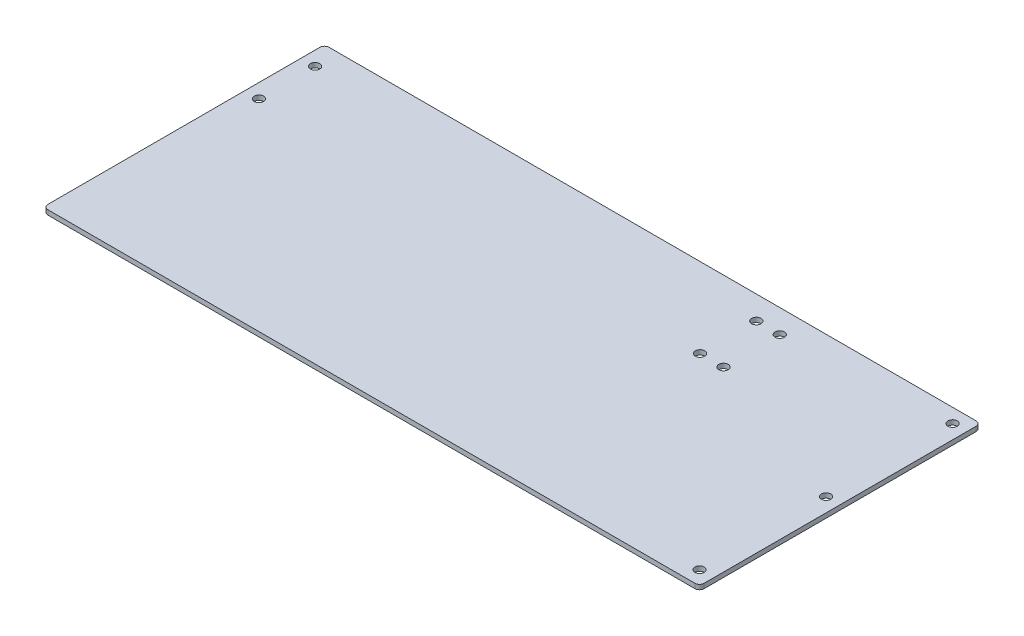
ISO-10303-21;
HEADER;
FILE_DESCRIPTION(('STEP AP214'),'2;1');
FILE_NAME('part.step','',(''),(''),'','','');
FILE_SCHEMA(('AUTOMOTIVE_DESIGN { 1 0 10303 214 1 1 1 1 }'));
ENDSEC;
DATA;
#1=APPLICATION_CONTEXT('core data for automotive mechanical design processes');
#2=APPLICATION_PROTOCOL_DEFINITION('international standard','automotive_design',2000,#1);
#3=PRODUCT_CONTEXT('',#1,'mechanical');
#4=PRODUCT('Part','Part','',(#3));
#5=PRODUCT_RELATED_PRODUCT_CATEGORY('part','',(#4));
#6=PRODUCT_DEFINITION_FORMATION('','',#4);
#7=PRODUCT_DEFINITION_CONTEXT('part definition',#1,'design');
#8=PRODUCT_DEFINITION('design','',#6,#7);
#9=PRODUCT_DEFINITION_SHAPE('','',#8);
#10=(LENGTH_UNIT() NAMED_UNIT(*) SI_UNIT(.MILLI.,.METRE.));
#11=(NAMED_UNIT(*) PLANE_ANGLE_UNIT() SI_UNIT($,.RADIAN.));
#12=(NAMED_UNIT(*) SI_UNIT($,.STERADIAN.) SOLID_ANGLE_UNIT());
#13=UNCERTAINTY_MEASURE_WITH_UNIT(LENGTH_MEASURE(1.E-05),#10,'distance_accuracy_value','');
#14=(GEOMETRIC_REPRESENTATION_CONTEXT(3) GLOBAL_UNCERTAINTY_ASSIGNED_CONTEXT((#13)) GLOBAL_UNIT_ASSIGNED_CONTEXT((#10,
#11,#12)) REPRESENTATION_CONTEXT('',''));
#15=CARTESIAN_POINT('',(0.,0.,0.));
#16=DIRECTION('',(0.,0.,1.));
#17=DIRECTION('',(1.,0.,0.));
#18=AXIS2_PLACEMENT_3D('',#15,#16,#17);
#19=CARTESIAN_POINT('',(222.25,3.175,-95.25));
#20=DIRECTION('',(-1.,0.,0.));
#21=DIRECTION('',(0.,0.,1.));
#22=AXIS2_PLACEMENT_3D('',#19,#20,#21);
#23=PLANE('',#22);
#24=DIRECTION('',(0.,0.,-1.));
#25=VECTOR('',#24,1.);
#26=CARTESIAN_POINT('',(222.25,0.,-95.25));
#27=LINE('',#26,#25);
#28=CARTESIAN_POINT('',(222.25,0.,92.075));
#29=VERTEX_POINT('',#28);
#30=CARTESIAN_POINT('',(222.25,0.,-92.075));
#31=VERTEX_POINT('',#30);
#32=EDGE_CURVE('E132',#29,#31,#27,.T.);
#33=ORIENTED_EDGE('',*,*,#32,.T.);
#34=DIRECTION('',(0.,-1.,0.));
#35=VECTOR('',#34,1.);
#36=CARTESIAN_POINT('',(222.25,3.175,-92.075));
#37=LINE('',#36,#35);
#38=CARTESIAN_POINT('',(222.25,3.175,-92.075));
#39=VERTEX_POINT('',#38);
#40=EDGE_CURVE('E110',#31,#39,#37,.F.);
#41=ORIENTED_EDGE('',*,*,#40,.T.);
#42=DIRECTION('',(0.,0.,-1.));
#43=VECTOR('',#42,1.);
#44=CARTESIAN_POINT('',(222.25,3.175,-95.25));
#45=LINE('',#44,#43);
#46=CARTESIAN_POINT('',(222.25,3.175,92.075));
#47=VERTEX_POINT('',#46);
#48=EDGE_CURVE('E142',#47,#39,#45,.T.);
#49=ORIENTED_EDGE('',*,*,#48,.F.);
#50=DIRECTION('',(0.,-1.,0.));
#51=VECTOR('',#50,1.);
#52=CARTESIAN_POINT('',(222.25,3.175,92.075));
#53=LINE('',#52,#51);
#54=EDGE_CURVE('E115',#47,#29,#53,.T.);
#55=ORIENTED_EDGE('',*,*,#54,.T.);
#56=EDGE_LOOP('',(#33,#41,#49,#55));
#57=FACE_BOUND('',#56,.T.);
#58=ADVANCED_FACE('F39',(#57),#23,.F.);
#59=CARTESIAN_POINT('',(-222.25,3.175,-95.25));
#60=DIRECTION('',(0.,0.,1.));
#61=DIRECTION('',(1.,0.,0.));
#62=AXIS2_PLACEMENT_3D('',#59,#60,#61);
#63=PLANE('',#62);
#64=DIRECTION('',(-1.,0.,0.));
#65=VECTOR('',#64,1.);
#66=CARTESIAN_POINT('',(-222.25,3.175,-95.25));
#67=LINE('',#66,#65);
#68=CARTESIAN_POINT('',(219.075,3.175,-95.25));
#69=VERTEX_POINT('',#68);
#70=CARTESIAN_POINT('',(-219.075,3.175,-95.25));
#71=VERTEX_POINT('',#70);
#72=EDGE_CURVE('E125',#69,#71,#67,.T.);
#73=ORIENTED_EDGE('',*,*,#72,.F.);
#74=DIRECTION('',(0.,-1.,0.));
#75=VECTOR('',#74,1.);
#76=CARTESIAN_POINT('',(219.075,3.175,-95.25));
#77=LINE('',#76,#75);
#78=CARTESIAN_POINT('',(219.075,0.,-95.25));
#79=VERTEX_POINT('',#78);
#80=EDGE_CURVE('E109',#69,#79,#77,.T.);
#81=ORIENTED_EDGE('',*,*,#80,.T.);
#82=DIRECTION('',(-1.,0.,0.));
#83=VECTOR('',#82,1.);
#84=CARTESIAN_POINT('',(-222.25,0.,-95.25));
#85=LINE('',#84,#83);
#86=CARTESIAN_POINT('',(-219.075,0.,-95.25));
#87=VERTEX_POINT('',#86);
#88=EDGE_CURVE('E122',#79,#87,#85,.T.);
#89=ORIENTED_EDGE('',*,*,#88,.T.);
#90=DIRECTION('',(0.,-1.,0.));
#91=VECTOR('',#90,1.);
#92=CARTESIAN_POINT('',(-219.075,3.175,-95.25));
#93=LINE('',#92,#91);
#94=EDGE_CURVE('E127',#87,#71,#93,.F.);
#95=ORIENTED_EDGE('',*,*,#94,.T.);
#96=EDGE_LOOP('',(#73,#81,#89,#95));
#97=FACE_BOUND('',#96,.T.);
#98=ADVANCED_FACE('F121',(#97),#63,.F.);
#99=CARTESIAN_POINT('',(-222.25,3.175,-95.25));
#100=DIRECTION('',(1.,0.,0.));
#101=DIRECTION('',(0.,0.,-1.));
#102=AXIS2_PLACEMENT_3D('',#99,#100,#101);
#103=PLANE('',#102);
#104=DIRECTION('',(0.,0.,1.));
#105=VECTOR('',#104,1.);
#106=CARTESIAN_POINT('',(-222.25,0.,-95.25));
#107=LINE('',#106,#105);
#108=CARTESIAN_POINT('',(-222.25,0.,-92.075));
#109=VERTEX_POINT('',#108);
#110=CARTESIAN_POINT('',(-222.25,0.,92.075));
#111=VERTEX_POINT('',#110);
#112=EDGE_CURVE('E131',#109,#111,#107,.T.);
#113=ORIENTED_EDGE('',*,*,#112,.T.);
#114=DIRECTION('',(0.,-1.,0.));
#115=VECTOR('',#114,1.);
#116=CARTESIAN_POINT('',(-222.25,3.175,92.075));
#117=LINE('',#116,#115);
#118=CARTESIAN_POINT('',(-222.25,3.175,92.075));
#119=VERTEX_POINT('',#118);
#120=EDGE_CURVE('E11',#111,#119,#117,.F.);
#121=ORIENTED_EDGE('',*,*,#120,.T.);
#122=DIRECTION('',(0.,0.,1.));
#123=VECTOR('',#122,1.);
#124=CARTESIAN_POINT('',(-222.25,3.175,-95.25));
#125=LINE('',#124,#123);
#126=CARTESIAN_POINT('',(-222.25,3.175,-92.075));
#127=VERTEX_POINT('',#126);
#128=EDGE_CURVE('E168',#127,#119,#125,.T.);
#129=ORIENTED_EDGE('',*,*,#128,.F.);
#130=DIRECTION('',(0.,-1.,0.));
#131=VECTOR('',#130,1.);
#132=CARTESIAN_POINT('',(-222.25,3.175,-92.075));
#133=LINE('',#132,#131);
#134=EDGE_CURVE('E47',#127,#109,#133,.T.);
#135=ORIENTED_EDGE('',*,*,#134,.T.);
#136=EDGE_LOOP('',(#113,#121,#129,#135));
#137=FACE_BOUND('',#136,.T.);
#138=ADVANCED_FACE('F166',(#137),#103,.F.);
#139=CARTESIAN_POINT('',(-222.25,3.175,95.25));
#140=DIRECTION('',(0.,0.,-1.));
#141=DIRECTION('',(-1.,0.,0.));
#142=AXIS2_PLACEMENT_3D('',#139,#140,#141);
#143=PLANE('',#142);
#144=DIRECTION('',(1.,0.,0.));
#145=VECTOR('',#144,1.);
#146=CARTESIAN_POINT('',(-222.25,0.,95.25));
#147=LINE('',#146,#145);
#148=CARTESIAN_POINT('',(-219.075,0.,95.25));
#149=VERTEX_POINT('',#148);
#150=CARTESIAN_POINT('',(219.075,0.,95.25));
#151=VERTEX_POINT('',#150);
#152=EDGE_CURVE('E135',#149,#151,#147,.T.);
#153=ORIENTED_EDGE('',*,*,#152,.T.);
#154=DIRECTION('',(0.,-1.,0.));
#155=VECTOR('',#154,1.);
#156=CARTESIAN_POINT('',(219.075,3.175,95.25));
#157=LINE('',#156,#155);
#158=CARTESIAN_POINT('',(219.075,3.175,95.25));
#159=VERTEX_POINT('',#158);
#160=EDGE_CURVE('E54',#151,#159,#157,.F.);
#161=ORIENTED_EDGE('',*,*,#160,.T.);
#162=DIRECTION('',(1.,0.,0.));
#163=VECTOR('',#162,1.);
#164=CARTESIAN_POINT('',(-222.25,3.175,95.25));
#165=LINE('',#164,#163);
#166=CARTESIAN_POINT('',(-219.075,3.175,95.25));
#167=VERTEX_POINT('',#166);
#168=EDGE_CURVE('E143',#167,#159,#165,.T.);
#169=ORIENTED_EDGE('',*,*,#168,.F.);
#170=DIRECTION('',(0.,-1.,0.));
#171=VECTOR('',#170,1.);
#172=CARTESIAN_POINT('',(-219.075,3.175,95.25));
#173=LINE('',#172,#171);
#174=EDGE_CURVE('E159',#167,#149,#173,.T.);
#175=ORIENTED_EDGE('',*,*,#174,.T.);
#176=EDGE_LOOP('',(#153,#161,#169,#175));
#177=FACE_BOUND('',#176,.T.);
#178=ADVANCED_FACE('F175',(#177),#143,.F.);
#179=CARTESIAN_POINT('',(0.,3.175,0.));
#180=DIRECTION('',(0.,1.,0.));
#181=DIRECTION('',(0.,0.,1.));
#182=AXIS2_PLACEMENT_3D('',#179,#180,#181);
#183=PLANE('',#182);
#184=CARTESIAN_POINT('',(212.725,3.175,-85.725));
#185=DIRECTION('',(0.,-1.,0.));
#186=DIRECTION('',(0.,0.,-1.));
#187=AXIS2_PLACEMENT_3D('',#184,#185,#186);
#188=CIRCLE('',#187,3.17500000000001);
#189=CARTESIAN_POINT('',(212.725,3.175,-88.9));
#190=VERTEX_POINT('',#189);
#191=EDGE_CURVE('E229',#190,#190,#188,.T.);
#192=ORIENTED_EDGE('',*,*,#191,.T.);
#193=EDGE_LOOP('',(#192));
#194=FACE_BOUND('',#193,.T.);
#195=CARTESIAN_POINT('',(212.725,3.175,0.));
#196=DIRECTION('',(0.,-1.,0.));
#197=DIRECTION('',(0.,0.,-1.));
#198=AXIS2_PLACEMENT_3D('',#195,#196,#197);
#199=CIRCLE('',#198,3.17500000000001);
#200=CARTESIAN_POINT('',(212.725,3.175,-3.17500000000001));
#201=VERTEX_POINT('',#200);
#202=EDGE_CURVE('E223',#201,#201,#199,.T.);
#203=ORIENTED_EDGE('',*,*,#202,.T.);
#204=EDGE_LOOP('',(#203));
#205=FACE_BOUND('',#204,.T.);
#206=CARTESIAN_POINT('',(212.725,3.175,85.725));
#207=DIRECTION('',(0.,-1.,0.));
#208=DIRECTION('',(0.,0.,-1.));
#209=AXIS2_PLACEMENT_3D('',#206,#207,#208);
#210=CIRCLE('',#209,3.17500000000001);
#211=CARTESIAN_POINT('',(212.725,3.175,82.55));
#212=VERTEX_POINT('',#211);
#213=EDGE_CURVE('E217',#212,#212,#210,.T.);
#214=ORIENTED_EDGE('',*,*,#213,.T.);
#215=EDGE_LOOP('',(#214));
#216=FACE_BOUND('',#215,.T.);
#217=CARTESIAN_POINT('',(-212.725,3.175,-79.375));
#218=DIRECTION('',(0.,1.,0.));
#219=DIRECTION('',(0.,0.,1.));
#220=AXIS2_PLACEMENT_3D('',#217,#218,#219);
#221=CIRCLE('',#220,3.17500000000001);
#222=CARTESIAN_POINT('',(-212.725,3.175,-76.2));
#223=VERTEX_POINT('',#222);
#224=EDGE_CURVE('E214',#223,#223,#221,.T.);
#225=ORIENTED_EDGE('',*,*,#224,.F.);
#226=EDGE_LOOP('',(#225));
#227=FACE_BOUND('',#226,.T.);
#228=CARTESIAN_POINT('',(-212.725,3.175,-41.275));
#229=DIRECTION('',(0.,1.,0.));
#230=DIRECTION('',(0.,0.,1.));
#231=AXIS2_PLACEMENT_3D('',#228,#229,#230);
#232=CIRCLE('',#231,3.17500000000001);
#233=CARTESIAN_POINT('',(-212.725,3.175,-38.1));
#234=VERTEX_POINT('',#233);
#235=EDGE_CURVE('E208',#234,#234,#232,.T.);
#236=ORIENTED_EDGE('',*,*,#235,.F.);
#237=EDGE_LOOP('',(#236));
#238=FACE_BOUND('',#237,.T.);
#239=CARTESIAN_POINT('',(101.981,3.175,-79.375));
#240=DIRECTION('',(0.,1.,0.));
#241=DIRECTION('',(0.,0.,1.));
#242=AXIS2_PLACEMENT_3D('',#239,#240,#241);
#243=CIRCLE('',#242,3.175);
#244=CARTESIAN_POINT('',(101.981,3.175,-76.2));
#245=VERTEX_POINT('',#244);
#246=EDGE_CURVE('E202',#245,#245,#243,.T.);
#247=ORIENTED_EDGE('',*,*,#246,.F.);
#248=EDGE_LOOP('',(#247));
#249=FACE_BOUND('',#248,.T.);
#250=CARTESIAN_POINT('',(101.981,3.175,-41.275));
#251=DIRECTION('',(0.,1.,0.));
#252=DIRECTION('',(0.,0.,1.));
#253=AXIS2_PLACEMENT_3D('',#250,#251,#252);
#254=CIRCLE('',#253,3.175);
#255=CARTESIAN_POINT('',(101.981,3.175,-38.1));
#256=VERTEX_POINT('',#255);
#257=EDGE_CURVE('E196',#256,#256,#254,.T.);
#258=ORIENTED_EDGE('',*,*,#257,.F.);
#259=EDGE_LOOP('',(#258));
#260=FACE_BOUND('',#259,.T.);
#261=CARTESIAN_POINT('',(86.106,3.175,-79.375));
#262=DIRECTION('',(0.,1.,0.));
#263=DIRECTION('',(0.,0.,1.));
#264=AXIS2_PLACEMENT_3D('',#261,#262,#263);
#265=CIRCLE('',#264,3.175);
#266=CARTESIAN_POINT('',(86.106,3.175,-76.2));
#267=VERTEX_POINT('',#266);
#268=EDGE_CURVE('E190',#267,#267,#265,.T.);
#269=ORIENTED_EDGE('',*,*,#268,.F.);
#270=EDGE_LOOP('',(#269));
#271=FACE_BOUND('',#270,.T.);
#272=CARTESIAN_POINT('',(86.106,3.175,-41.275));
#273=DIRECTION('',(0.,1.,0.));
#274=DIRECTION('',(0.,0.,1.));
#275=AXIS2_PLACEMENT_3D('',#272,#273,#274);
#276=CIRCLE('',#275,3.175);
#277=CARTESIAN_POINT('',(86.106,3.175,-38.1));
#278=VERTEX_POINT('',#277);
#279=EDGE_CURVE('E184',#278,#278,#276,.T.);
#280=ORIENTED_EDGE('',*,*,#279,.F.);
#281=EDGE_LOOP('',(#280));
#282=FACE_BOUND('',#281,.T.);
#283=ORIENTED_EDGE('',*,*,#48,.T.);
#284=CARTESIAN_POINT('',(219.075,3.175,-92.075));
#285=DIRECTION('',(0.,1.,0.));
#286=DIRECTION('',(0.,0.,1.));
#287=AXIS2_PLACEMENT_3D('',#284,#285,#286);
#288=CIRCLE('',#287,3.175);
#289=EDGE_CURVE('E157',#39,#69,#288,.T.);
#290=ORIENTED_EDGE('',*,*,#289,.T.);
#291=ORIENTED_EDGE('',*,*,#72,.T.);
#292=CARTESIAN_POINT('',(-219.075,3.175,-92.075));
#293=DIRECTION('',(0.,1.,0.));
#294=DIRECTION('',(0.,0.,1.));
#295=AXIS2_PLACEMENT_3D('',#292,#293,#294);
#296=CIRCLE('',#295,3.175);
#297=EDGE_CURVE('E152',#71,#127,#296,.T.);
#298=ORIENTED_EDGE('',*,*,#297,.T.);
#299=ORIENTED_EDGE('',*,*,#128,.T.);
#300=CARTESIAN_POINT('',(-219.075,3.175,92.075));
#301=DIRECTION('',(0.,1.,0.));
#302=DIRECTION('',(0.,0.,1.));
#303=AXIS2_PLACEMENT_3D('',#300,#301,#302);
#304=CIRCLE('',#303,3.175);
#305=EDGE_CURVE('E61',#119,#167,#304,.T.);
#306=ORIENTED_EDGE('',*,*,#305,.T.);
#307=ORIENTED_EDGE('',*,*,#168,.T.);
#308=CARTESIAN_POINT('',(219.075,3.175,92.075));
#309=DIRECTION('',(0.,1.,0.));
#310=DIRECTION('',(0.,0.,1.));
#311=AXIS2_PLACEMENT_3D('',#308,#309,#310);
#312=CIRCLE('',#311,3.175);
#313=EDGE_CURVE('E155',#159,#47,#312,.T.);
#314=ORIENTED_EDGE('',*,*,#313,.T.);
#315=EDGE_LOOP('',(#283,#290,#291,#298,#299,#306,#307,#314));
#316=FACE_BOUND('',#315,.T.);
#317=ADVANCED_FACE('F241',(#194,#205,#216,#227,#238,#249,#260,#271,#282,#316),#183,.T.);
#318=CARTESIAN_POINT('',(0.,0.,0.));
#319=DIRECTION('',(0.,1.,0.));
#320=DIRECTION('',(0.,0.,1.));
#321=AXIS2_PLACEMENT_3D('',#318,#319,#320);
#322=PLANE('',#321);
#323=CARTESIAN_POINT('',(212.725,0.,-85.725));
#324=DIRECTION('',(0.,-1.,0.));
#325=DIRECTION('',(0.,0.,-1.));
#326=AXIS2_PLACEMENT_3D('',#323,#324,#325);
#327=CIRCLE('',#326,3.17499999999998);
#328=CARTESIAN_POINT('',(212.725,0.,-88.9));
#329=VERTEX_POINT('',#328);
#330=EDGE_CURVE('E232',#329,#329,#327,.T.);
#331=ORIENTED_EDGE('',*,*,#330,.F.);
#332=EDGE_LOOP('',(#331));
#333=FACE_BOUND('',#332,.T.);
#334=CARTESIAN_POINT('',(212.725,0.,0.));
#335=DIRECTION('',(0.,-1.,0.));
#336=DIRECTION('',(0.,0.,-1.));
#337=AXIS2_PLACEMENT_3D('',#334,#335,#336);
#338=CIRCLE('',#337,3.17499999999998);
#339=CARTESIAN_POINT('',(212.725,0.,-3.17499999999998));
#340=VERTEX_POINT('',#339);
#341=EDGE_CURVE('E226',#340,#340,#338,.T.);
#342=ORIENTED_EDGE('',*,*,#341,.F.);
#343=EDGE_LOOP('',(#342));
#344=FACE_BOUND('',#343,.T.);
#345=CARTESIAN_POINT('',(212.725,0.,85.725));
#346=DIRECTION('',(0.,-1.,0.));
#347=DIRECTION('',(0.,0.,-1.));
#348=AXIS2_PLACEMENT_3D('',#345,#346,#347);
#349=CIRCLE('',#348,3.17499999999998);
#350=CARTESIAN_POINT('',(212.725,0.,82.55));
#351=VERTEX_POINT('',#350);
#352=EDGE_CURVE('E220',#351,#351,#349,.T.);
#353=ORIENTED_EDGE('',*,*,#352,.F.);
#354=EDGE_LOOP('',(#353));
#355=FACE_BOUND('',#354,.T.);
#356=CARTESIAN_POINT('',(-212.725,0.,-79.375));
#357=DIRECTION('',(0.,1.,0.));
#358=DIRECTION('',(0.,0.,1.));
#359=AXIS2_PLACEMENT_3D('',#356,#357,#358);
#360=CIRCLE('',#359,3.17500000000001);
#361=CARTESIAN_POINT('',(-212.725,0.,-76.2));
#362=VERTEX_POINT('',#361);
#363=EDGE_CURVE('E211',#362,#362,#360,.T.);
#364=ORIENTED_EDGE('',*,*,#363,.T.);
#365=EDGE_LOOP('',(#364));
#366=FACE_BOUND('',#365,.T.);
#367=CARTESIAN_POINT('',(-212.725,0.,-41.275));
#368=DIRECTION('',(0.,1.,0.));
#369=DIRECTION('',(0.,0.,1.));
#370=AXIS2_PLACEMENT_3D('',#367,#368,#369);
#371=CIRCLE('',#370,3.17500000000001);
#372=CARTESIAN_POINT('',(-212.725,0.,-38.1));
#373=VERTEX_POINT('',#372);
#374=EDGE_CURVE('E205',#373,#373,#371,.T.);
#375=ORIENTED_EDGE('',*,*,#374,.T.);
#376=EDGE_LOOP('',(#375));
#377=FACE_BOUND('',#376,.T.);
#378=CARTESIAN_POINT('',(101.981,0.,-79.375));
#379=DIRECTION('',(0.,1.,0.));
#380=DIRECTION('',(0.,0.,1.));
#381=AXIS2_PLACEMENT_3D('',#378,#379,#380);
#382=CIRCLE('',#381,3.175);
#383=CARTESIAN_POINT('',(101.981,0.,-76.2));
#384=VERTEX_POINT('',#383);
#385=EDGE_CURVE('E199',#384,#384,#382,.T.);
#386=ORIENTED_EDGE('',*,*,#385,.T.);
#387=EDGE_LOOP('',(#386));
#388=FACE_BOUND('',#387,.T.);
#389=CARTESIAN_POINT('',(101.981,0.,-41.275));
#390=DIRECTION('',(0.,1.,0.));
#391=DIRECTION('',(0.,0.,1.));
#392=AXIS2_PLACEMENT_3D('',#389,#390,#391);
#393=CIRCLE('',#392,3.175);
#394=CARTESIAN_POINT('',(101.981,0.,-38.1));
#395=VERTEX_POINT('',#394);
#396=EDGE_CURVE('E193',#395,#395,#393,.T.);
#397=ORIENTED_EDGE('',*,*,#396,.T.);
#398=EDGE_LOOP('',(#397));
#399=FACE_BOUND('',#398,.T.);
#400=CARTESIAN_POINT('',(86.106,0.,-79.375));
#401=DIRECTION('',(0.,1.,0.));
#402=DIRECTION('',(0.,0.,1.));
#403=AXIS2_PLACEMENT_3D('',#400,#401,#402);
#404=CIRCLE('',#403,3.175);
#405=CARTESIAN_POINT('',(86.106,0.,-76.2));
#406=VERTEX_POINT('',#405);
#407=EDGE_CURVE('E187',#406,#406,#404,.T.);
#408=ORIENTED_EDGE('',*,*,#407,.T.);
#409=EDGE_LOOP('',(#408));
#410=FACE_BOUND('',#409,.T.);
#411=CARTESIAN_POINT('',(86.106,0.,-41.275));
#412=DIRECTION('',(0.,1.,0.));
#413=DIRECTION('',(0.,0.,1.));
#414=AXIS2_PLACEMENT_3D('',#411,#412,#413);
#415=CIRCLE('',#414,3.175);
#416=CARTESIAN_POINT('',(86.106,0.,-38.1));
#417=VERTEX_POINT('',#416);
#418=EDGE_CURVE('E137',#417,#417,#415,.T.);
#419=ORIENTED_EDGE('',*,*,#418,.T.);
#420=EDGE_LOOP('',(#419));
#421=FACE_BOUND('',#420,.T.);
#422=ORIENTED_EDGE('',*,*,#88,.F.);
#423=CARTESIAN_POINT('',(219.075,0.,-92.075));
#424=DIRECTION('',(0.,1.,0.));
#425=DIRECTION('',(0.,0.,1.));
#426=AXIS2_PLACEMENT_3D('',#423,#424,#425);
#427=CIRCLE('',#426,3.175);
#428=EDGE_CURVE('E105',#79,#31,#427,.F.);
#429=ORIENTED_EDGE('',*,*,#428,.T.);
#430=ORIENTED_EDGE('',*,*,#32,.F.);
#431=CARTESIAN_POINT('',(219.075,0.,92.075));
#432=DIRECTION('',(0.,1.,0.));
#433=DIRECTION('',(0.,0.,1.));
#434=AXIS2_PLACEMENT_3D('',#431,#432,#433);
#435=CIRCLE('',#434,3.175);
#436=EDGE_CURVE('E116',#29,#151,#435,.F.);
#437=ORIENTED_EDGE('',*,*,#436,.T.);
#438=ORIENTED_EDGE('',*,*,#152,.F.);
#439=CARTESIAN_POINT('',(-219.075,0.,92.075));
#440=DIRECTION('',(0.,1.,0.));
#441=DIRECTION('',(0.,0.,1.));
#442=AXIS2_PLACEMENT_3D('',#439,#440,#441);
#443=CIRCLE('',#442,3.175);
#444=EDGE_CURVE('E146',#149,#111,#443,.F.);
#445=ORIENTED_EDGE('',*,*,#444,.T.);
#446=ORIENTED_EDGE('',*,*,#112,.F.);
#447=CARTESIAN_POINT('',(-219.075,0.,-92.075));
#448=DIRECTION('',(0.,1.,0.));
#449=DIRECTION('',(0.,0.,1.));
#450=AXIS2_PLACEMENT_3D('',#447,#448,#449);
#451=CIRCLE('',#450,3.175);
#452=EDGE_CURVE('E126',#109,#87,#451,.F.);
#453=ORIENTED_EDGE('',*,*,#452,.T.);
#454=EDGE_LOOP('',(#422,#429,#430,#437,#438,#445,#446,#453));
#455=FACE_BOUND('',#454,.T.);
#456=ADVANCED_FACE('F129',(#333,#344,#355,#366,#377,#388,#399,#410,#421,#455),#322,.F.);
#457=CARTESIAN_POINT('',(86.106,3.175,-41.275));
#458=DIRECTION('',(0.,1.,0.));
#459=DIRECTION('',(0.,0.,1.));
#460=AXIS2_PLACEMENT_3D('',#457,#458,#459);
#461=CYLINDRICAL_SURFACE('',#460,3.175);
#462=ORIENTED_EDGE('',*,*,#418,.F.);
#463=EDGE_LOOP('',(#462));
#464=FACE_BOUND('',#463,.T.);
#465=ORIENTED_EDGE('',*,*,#279,.T.);
#466=EDGE_LOOP('',(#465));
#467=FACE_BOUND('',#466,.T.);
#468=ADVANCED_FACE('F240',(#464,#467),#461,.F.);
#469=CARTESIAN_POINT('',(86.106,3.175,-79.375));
#470=DIRECTION('',(0.,1.,0.));
#471=DIRECTION('',(0.,0.,1.));
#472=AXIS2_PLACEMENT_3D('',#469,#470,#471);
#473=CYLINDRICAL_SURFACE('',#472,3.175);
#474=ORIENTED_EDGE('',*,*,#407,.F.);
#475=EDGE_LOOP('',(#474));
#476=FACE_BOUND('',#475,.T.);
#477=ORIENTED_EDGE('',*,*,#268,.T.);
#478=EDGE_LOOP('',(#477));
#479=FACE_BOUND('',#478,.T.);
#480=ADVANCED_FACE('F261',(#476,#479),#473,.F.);
#481=CARTESIAN_POINT('',(101.981,3.175,-41.275));
#482=DIRECTION('',(0.,1.,0.));
#483=DIRECTION('',(0.,0.,1.));
#484=AXIS2_PLACEMENT_3D('',#481,#482,#483);
#485=CYLINDRICAL_SURFACE('',#484,3.175);
#486=ORIENTED_EDGE('',*,*,#396,.F.);
#487=EDGE_LOOP('',(#486));
#488=FACE_BOUND('',#487,.T.);
#489=ORIENTED_EDGE('',*,*,#257,.T.);
#490=EDGE_LOOP('',(#489));
#491=FACE_BOUND('',#490,.T.);
#492=ADVANCED_FACE('F295',(#488,#491),#485,.F.);
#493=CARTESIAN_POINT('',(101.981,3.175,-79.375));
#494=DIRECTION('',(0.,1.,0.));
#495=DIRECTION('',(0.,0.,1.));
#496=AXIS2_PLACEMENT_3D('',#493,#494,#495);
#497=CYLINDRICAL_SURFACE('',#496,3.175);
#498=ORIENTED_EDGE('',*,*,#385,.F.);
#499=EDGE_LOOP('',(#498));
#500=FACE_BOUND('',#499,.T.);
#501=ORIENTED_EDGE('',*,*,#246,.T.);
#502=EDGE_LOOP('',(#501));
#503=FACE_BOUND('',#502,.T.);
#504=ADVANCED_FACE('F299',(#500,#503),#497,.F.);
#505=CARTESIAN_POINT('',(-212.725,3.175,-41.275));
#506=DIRECTION('',(0.,1.,0.));
#507=DIRECTION('',(0.,0.,1.));
#508=AXIS2_PLACEMENT_3D('',#505,#506,#507);
#509=CYLINDRICAL_SURFACE('',#508,3.17500000000001);
#510=ORIENTED_EDGE('',*,*,#374,.F.);
#511=EDGE_LOOP('',(#510));
#512=FACE_BOUND('',#511,.T.);
#513=ORIENTED_EDGE('',*,*,#235,.T.);
#514=EDGE_LOOP('',(#513));
#515=FACE_BOUND('',#514,.T.);
#516=ADVANCED_FACE('F303',(#512,#515),#509,.F.);
#517=CARTESIAN_POINT('',(-212.725,3.175,-79.375));
#518=DIRECTION('',(0.,1.,0.));
#519=DIRECTION('',(0.,0.,1.));
#520=AXIS2_PLACEMENT_3D('',#517,#518,#519);
#521=CYLINDRICAL_SURFACE('',#520,3.17500000000001);
#522=ORIENTED_EDGE('',*,*,#363,.F.);
#523=EDGE_LOOP('',(#522));
#524=FACE_BOUND('',#523,.T.);
#525=ORIENTED_EDGE('',*,*,#224,.T.);
#526=EDGE_LOOP('',(#525));
#527=FACE_BOUND('',#526,.T.);
#528=ADVANCED_FACE('F279',(#524,#527),#521,.F.);
#529=CARTESIAN_POINT('',(219.075,3.175,-92.075));
#530=DIRECTION('',(0.,-1.,0.));
#531=DIRECTION('',(0.,0.,-1.));
#532=AXIS2_PLACEMENT_3D('',#529,#530,#531);
#533=CYLINDRICAL_SURFACE('',#532,3.175);
#534=ORIENTED_EDGE('',*,*,#289,.F.);
#535=ORIENTED_EDGE('',*,*,#40,.F.);
#536=ORIENTED_EDGE('',*,*,#428,.F.);
#537=ORIENTED_EDGE('',*,*,#80,.F.);
#538=EDGE_LOOP('',(#534,#535,#536,#537));
#539=FACE_BOUND('',#538,.T.);
#540=ADVANCED_FACE('F108',(#539),#533,.T.);
#541=CARTESIAN_POINT('',(219.075,3.175,92.075));
#542=DIRECTION('',(0.,-1.,0.));
#543=DIRECTION('',(0.,0.,-1.));
#544=AXIS2_PLACEMENT_3D('',#541,#542,#543);
#545=CYLINDRICAL_SURFACE('',#544,3.175);
#546=ORIENTED_EDGE('',*,*,#313,.F.);
#547=ORIENTED_EDGE('',*,*,#160,.F.);
#548=ORIENTED_EDGE('',*,*,#436,.F.);
#549=ORIENTED_EDGE('',*,*,#54,.F.);
#550=EDGE_LOOP('',(#546,#547,#548,#549));
#551=FACE_BOUND('',#550,.T.);
#552=ADVANCED_FACE('F272',(#551),#545,.T.);
#553=CARTESIAN_POINT('',(-219.075,3.175,92.075));
#554=DIRECTION('',(0.,-1.,0.));
#555=DIRECTION('',(0.,0.,-1.));
#556=AXIS2_PLACEMENT_3D('',#553,#554,#555);
#557=CYLINDRICAL_SURFACE('',#556,3.175);
#558=ORIENTED_EDGE('',*,*,#305,.F.);
#559=ORIENTED_EDGE('',*,*,#120,.F.);
#560=ORIENTED_EDGE('',*,*,#444,.F.);
#561=ORIENTED_EDGE('',*,*,#174,.F.);
#562=EDGE_LOOP('',(#558,#559,#560,#561));
#563=FACE_BOUND('',#562,.T.);
#564=ADVANCED_FACE('F174',(#563),#557,.T.);
#565=CARTESIAN_POINT('',(-219.075,3.175,-92.075));
#566=DIRECTION('',(0.,-1.,0.));
#567=DIRECTION('',(0.,0.,-1.));
#568=AXIS2_PLACEMENT_3D('',#565,#566,#567);
#569=CYLINDRICAL_SURFACE('',#568,3.175);
#570=ORIENTED_EDGE('',*,*,#297,.F.);
#571=ORIENTED_EDGE('',*,*,#94,.F.);
#572=ORIENTED_EDGE('',*,*,#452,.F.);
#573=ORIENTED_EDGE('',*,*,#134,.F.);
#574=EDGE_LOOP('',(#570,#571,#572,#573));
#575=FACE_BOUND('',#574,.T.);
#576=ADVANCED_FACE('F41',(#575),#569,.T.);
#577=CARTESIAN_POINT('',(212.725,0.,85.725));
#578=DIRECTION('',(0.,-1.,0.));
#579=DIRECTION('',(0.,0.,-1.));
#580=AXIS2_PLACEMENT_3D('',#577,#578,#579);
#581=CYLINDRICAL_SURFACE('',#580,3.175);
#582=ORIENTED_EDGE('',*,*,#213,.F.);
#583=EDGE_LOOP('',(#582));
#584=FACE_BOUND('',#583,.T.);
#585=ORIENTED_EDGE('',*,*,#352,.T.);
#586=EDGE_LOOP('',(#585));
#587=FACE_BOUND('',#586,.T.);
#588=ADVANCED_FACE('F310',(#584,#587),#581,.F.);
#589=CARTESIAN_POINT('',(212.725,0.,0.));
#590=DIRECTION('',(0.,-1.,0.));
#591=DIRECTION('',(0.,0.,-1.));
#592=AXIS2_PLACEMENT_3D('',#589,#590,#591);
#593=CYLINDRICAL_SURFACE('',#592,3.175);
#594=ORIENTED_EDGE('',*,*,#202,.F.);
#595=EDGE_LOOP('',(#594));
#596=FACE_BOUND('',#595,.T.);
#597=ORIENTED_EDGE('',*,*,#341,.T.);
#598=EDGE_LOOP('',(#597));
#599=FACE_BOUND('',#598,.T.);
#600=ADVANCED_FACE('F313',(#596,#599),#593,.F.);
#601=CARTESIAN_POINT('',(212.725,0.,-85.725));
#602=DIRECTION('',(0.,-1.,0.));
#603=DIRECTION('',(0.,0.,-1.));
#604=AXIS2_PLACEMENT_3D('',#601,#602,#603);
#605=CYLINDRICAL_SURFACE('',#604,3.175);
#606=ORIENTED_EDGE('',*,*,#191,.F.);
#607=EDGE_LOOP('',(#606));
#608=FACE_BOUND('',#607,.T.);
#609=ORIENTED_EDGE('',*,*,#330,.T.);
#610=EDGE_LOOP('',(#609));
#611=FACE_BOUND('',#610,.T.);
#612=ADVANCED_FACE('F236',(#608,#611),#605,.F.);
#613=CLOSED_SHELL('',(#58,#98,#138,#178,#317,#456,#468,#480,#492,#504,#516,#528,#540,#552,#564,
#576,#588,#600,#612));
#614=MANIFOLD_SOLID_BREP('B2',#613);
#615=ADVANCED_BREP_SHAPE_REPRESENTATION('',(#18,#614),#14);
#616=SHAPE_DEFINITION_REPRESENTATION(#9,#615);
ENDSEC;
END-ISO-10303-21;
